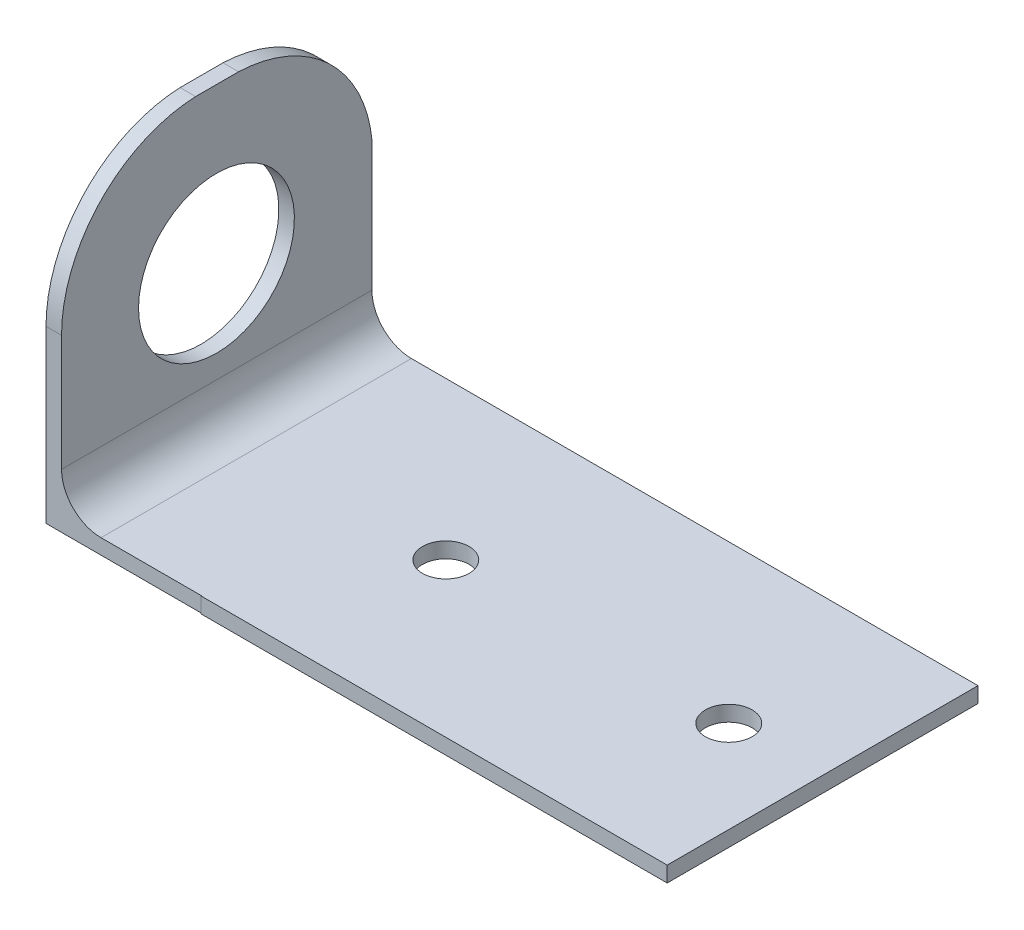
ISO-10303-21;
HEADER;
FILE_DESCRIPTION(('STEP AP214'),'2;1');
FILE_NAME('part.step','',(''),(''),'','','');
FILE_SCHEMA(('AUTOMOTIVE_DESIGN { 1 0 10303 214 1 1 1 1 }'));
ENDSEC;
DATA;
#1=APPLICATION_CONTEXT('core data for automotive mechanical design processes');
#2=APPLICATION_PROTOCOL_DEFINITION('international standard','automotive_design',2000,#1);
#3=PRODUCT_CONTEXT('',#1,'mechanical');
#4=PRODUCT('Part','Part','',(#3));
#5=PRODUCT_RELATED_PRODUCT_CATEGORY('part','',(#4));
#6=PRODUCT_DEFINITION_FORMATION('','',#4);
#7=PRODUCT_DEFINITION_CONTEXT('part definition',#1,'design');
#8=PRODUCT_DEFINITION('design','',#6,#7);
#9=PRODUCT_DEFINITION_SHAPE('','',#8);
#10=(LENGTH_UNIT() NAMED_UNIT(*) SI_UNIT(.MILLI.,.METRE.));
#11=(NAMED_UNIT(*) PLANE_ANGLE_UNIT() SI_UNIT($,.RADIAN.));
#12=(NAMED_UNIT(*) SI_UNIT($,.STERADIAN.) SOLID_ANGLE_UNIT());
#13=UNCERTAINTY_MEASURE_WITH_UNIT(LENGTH_MEASURE(1.E-05),#10,'distance_accuracy_value','');
#14=(GEOMETRIC_REPRESENTATION_CONTEXT(3) GLOBAL_UNCERTAINTY_ASSIGNED_CONTEXT((#13)) GLOBAL_UNIT_ASSIGNED_CONTEXT((#10,
#11,#12)) REPRESENTATION_CONTEXT('',''));
#15=CARTESIAN_POINT('',(0.,0.,0.));
#16=DIRECTION('',(0.,0.,1.));
#17=DIRECTION('',(1.,0.,0.));
#18=AXIS2_PLACEMENT_3D('',#15,#16,#17);
#19=CARTESIAN_POINT('',(0.,0.,20.));
#20=DIRECTION('',(1.,0.,0.));
#21=DIRECTION('',(0.,0.,-1.));
#22=AXIS2_PLACEMENT_3D('',#19,#20,#21);
#23=PLANE('',#22);
#24=CARTESIAN_POINT('',(0.,10.0362534456912,10.002916516571));
#25=DIRECTION('',(-1.,0.,0.));
#26=DIRECTION('',(0.,0.,1.));
#27=AXIS2_PLACEMENT_3D('',#24,#25,#26);
#28=CIRCLE('',#27,5.01471082260615);
#29=CARTESIAN_POINT('',(0.,10.0362534456912,15.0176273391771));
#30=VERTEX_POINT('',#29);
#31=EDGE_CURVE('E200',#30,#30,#28,.T.);
#32=ORIENTED_EDGE('',*,*,#31,.F.);
#33=EDGE_LOOP('',(#32));
#34=FACE_BOUND('',#33,.T.);
#35=CARTESIAN_POINT('',(0.,11.0076719576721,8.95236583522298));
#36=DIRECTION('',(-1.,0.,0.));
#37=DIRECTION('',(0.,0.,1.));
#38=AXIS2_PLACEMENT_3D('',#35,#36,#37);
#39=CIRCLE('',#38,9.);
#40=CARTESIAN_POINT('',(0.,20.,8.58083336132213));
#41=VERTEX_POINT('',#40);
#42=CARTESIAN_POINT('',(0.,11.9324129767322,0.));
#43=VERTEX_POINT('',#42);
#44=EDGE_CURVE('E151',#41,#43,#39,.T.);
#45=ORIENTED_EDGE('',*,*,#44,.T.);
#46=DIRECTION('',(0.,-1.,0.));
#47=VECTOR('',#46,1.);
#48=CARTESIAN_POINT('',(0.,0.,0.));
#49=LINE('',#48,#47);
#50=CARTESIAN_POINT('',(0.,0.0255102040817569,0.));
#51=VERTEX_POINT('',#50);
#52=EDGE_CURVE('E199',#43,#51,#49,.T.);
#53=ORIENTED_EDGE('',*,*,#52,.T.);
#54=DIRECTION('',(0.,0.,1.));
#55=VECTOR('',#54,1.);
#56=CARTESIAN_POINT('',(0.,0.0255102040817569,0.));
#57=LINE('',#56,#55);
#58=CARTESIAN_POINT('',(0.,0.0255102040817569,19.9722297808012));
#59=VERTEX_POINT('',#58);
#60=EDGE_CURVE('E247',#51,#59,#57,.T.);
#61=ORIENTED_EDGE('',*,*,#60,.T.);
#62=DIRECTION('',(0.,-1.,0.));
#63=VECTOR('',#62,1.);
#64=CARTESIAN_POINT('',(0.,0.,19.9722297808012));
#65=LINE('',#64,#63);
#66=CARTESIAN_POINT('',(0.,11.007671957672,19.9722297808012));
#67=VERTEX_POINT('',#66);
#68=EDGE_CURVE('E251',#67,#59,#65,.T.);
#69=ORIENTED_EDGE('',*,*,#68,.F.);
#70=CARTESIAN_POINT('',(0.,11.0076719576721,10.9722297808012));
#71=DIRECTION('',(-1.,0.,0.));
#72=DIRECTION('',(0.,0.,1.));
#73=AXIS2_PLACEMENT_3D('',#70,#71,#72);
#74=CIRCLE('',#73,9.);
#75=CARTESIAN_POINT('',(0.,20.,11.3437622547021));
#76=VERTEX_POINT('',#75);
#77=EDGE_CURVE('E169',#76,#67,#74,.F.);
#78=ORIENTED_EDGE('',*,*,#77,.F.);
#79=DIRECTION('',(0.,0.,-1.));
#80=VECTOR('',#79,1.);
#81=CARTESIAN_POINT('',(0.,20.,20.));
#82=LINE('',#81,#80);
#83=EDGE_CURVE('E166',#76,#41,#82,.T.);
#84=ORIENTED_EDGE('',*,*,#83,.T.);
#85=EDGE_LOOP('',(#45,#53,#61,#69,#78,#84));
#86=FACE_BOUND('',#85,.T.);
#87=ADVANCED_FACE('F64',(#34,#86),#23,.F.);
#88=CARTESIAN_POINT('',(0.,0.,20.));
#89=DIRECTION('',(0.,1.,0.));
#90=DIRECTION('',(0.,0.,1.));
#91=AXIS2_PLACEMENT_3D('',#88,#89,#90);
#92=PLANE('',#91);
#93=CARTESIAN_POINT('',(34.0793672831904,0.,10.1164192432048));
#94=DIRECTION('',(0.,1.,0.));
#95=DIRECTION('',(0.,0.,1.));
#96=AXIS2_PLACEMENT_3D('',#93,#94,#95);
#97=CIRCLE('',#96,1.5);
#98=CARTESIAN_POINT('',(34.0793672831904,0.,11.6164192432048));
#99=VERTEX_POINT('',#98);
#100=EDGE_CURVE('E269',#99,#99,#97,.T.);
#101=ORIENTED_EDGE('',*,*,#100,.T.);
#102=EDGE_LOOP('',(#101));
#103=FACE_BOUND('',#102,.T.);
#104=CARTESIAN_POINT('',(15.8713976459673,0.,10.1164192432048));
#105=DIRECTION('',(0.,1.,0.));
#106=DIRECTION('',(0.,0.,1.));
#107=AXIS2_PLACEMENT_3D('',#104,#105,#106);
#108=CIRCLE('',#107,1.5);
#109=CARTESIAN_POINT('',(15.8713976459673,0.,11.6164192432048));
#110=VERTEX_POINT('',#109);
#111=EDGE_CURVE('E159',#110,#110,#108,.T.);
#112=ORIENTED_EDGE('',*,*,#111,.T.);
#113=EDGE_LOOP('',(#112));
#114=FACE_BOUND('',#113,.T.);
#115=DIRECTION('',(0.,0.,1.));
#116=VECTOR('',#115,1.);
#117=CARTESIAN_POINT('',(10.,0.,0.));
#118=LINE('',#117,#116);
#119=CARTESIAN_POINT('',(10.,0.,0.));
#120=VERTEX_POINT('',#119);
#121=CARTESIAN_POINT('',(10.,0.,20.));
#122=VERTEX_POINT('',#121);
#123=EDGE_CURVE('E241',#120,#122,#118,.T.);
#124=ORIENTED_EDGE('',*,*,#123,.F.);
#125=DIRECTION('',(1.,0.,0.));
#126=VECTOR('',#125,1.);
#127=CARTESIAN_POINT('',(0.,0.,0.));
#128=LINE('',#127,#126);
#129=CARTESIAN_POINT('',(40.,0.,0.));
#130=VERTEX_POINT('',#129);
#131=EDGE_CURVE('E219',#120,#130,#128,.T.);
#132=ORIENTED_EDGE('',*,*,#131,.T.);
#133=DIRECTION('',(0.,0.,-1.));
#134=VECTOR('',#133,1.);
#135=CARTESIAN_POINT('',(40.,0.,20.));
#136=LINE('',#135,#134);
#137=CARTESIAN_POINT('',(40.,0.,20.));
#138=VERTEX_POINT('',#137);
#139=EDGE_CURVE('E187',#138,#130,#136,.T.);
#140=ORIENTED_EDGE('',*,*,#139,.F.);
#141=DIRECTION('',(1.,0.,0.));
#142=VECTOR('',#141,1.);
#143=CARTESIAN_POINT('',(0.,0.,20.));
#144=LINE('',#143,#142);
#145=EDGE_CURVE('E218',#122,#138,#144,.T.);
#146=ORIENTED_EDGE('',*,*,#145,.F.);
#147=EDGE_LOOP('',(#124,#132,#140,#146));
#148=FACE_BOUND('',#147,.T.);
#149=ADVANCED_FACE('F291',(#103,#114,#148),#92,.F.);
#150=CARTESIAN_POINT('',(1.,20.,20.));
#151=DIRECTION('',(-1.,0.,0.));
#152=DIRECTION('',(0.,-1.,0.));
#153=AXIS2_PLACEMENT_3D('',#150,#151,#152);
#154=PLANE('',#153);
#155=CARTESIAN_POINT('',(1.,10.0362534456912,10.002916516571));
#156=DIRECTION('',(-1.,0.,0.));
#157=DIRECTION('',(0.,-1.,0.));
#158=AXIS2_PLACEMENT_3D('',#155,#156,#157);
#159=CIRCLE('',#158,5.01471082260615);
#160=CARTESIAN_POINT('',(1.00000000000001,5.02154262308502,10.002916516571));
#161=VERTEX_POINT('',#160);
#162=EDGE_CURVE('E197',#161,#161,#159,.T.);
#163=ORIENTED_EDGE('',*,*,#162,.T.);
#164=EDGE_LOOP('',(#163));
#165=FACE_BOUND('',#164,.T.);
#166=CARTESIAN_POINT('',(1.,11.0076719576721,8.95236583522298));
#167=DIRECTION('',(-1.,0.,0.));
#168=DIRECTION('',(0.,-1.,0.));
#169=AXIS2_PLACEMENT_3D('',#166,#167,#168);
#170=CIRCLE('',#169,9.);
#171=CARTESIAN_POINT('',(1.,20.,8.58083336132213));
#172=VERTEX_POINT('',#171);
#173=CARTESIAN_POINT('',(1.,11.9324129767322,0.));
#174=VERTEX_POINT('',#173);
#175=EDGE_CURVE('E79',#172,#174,#170,.T.);
#176=ORIENTED_EDGE('',*,*,#175,.F.);
#177=DIRECTION('',(0.,0.,-1.));
#178=VECTOR('',#177,1.);
#179=CARTESIAN_POINT('',(1.,20.,20.));
#180=LINE('',#179,#178);
#181=CARTESIAN_POINT('',(1.,20.,11.3437622547021));
#182=VERTEX_POINT('',#181);
#183=EDGE_CURVE('E168',#182,#172,#180,.T.);
#184=ORIENTED_EDGE('',*,*,#183,.F.);
#185=CARTESIAN_POINT('',(1.,11.0076719576721,10.9722297808012));
#186=DIRECTION('',(-1.,0.,0.));
#187=DIRECTION('',(0.,-1.,0.));
#188=AXIS2_PLACEMENT_3D('',#185,#186,#187);
#189=CIRCLE('',#188,9.);
#190=CARTESIAN_POINT('',(1.00000000000001,11.007671957672,19.9722297808012));
#191=VERTEX_POINT('',#190);
#192=EDGE_CURVE('E228',#182,#191,#189,.F.);
#193=ORIENTED_EDGE('',*,*,#192,.T.);
#194=DIRECTION('',(0.,-1.,0.));
#195=VECTOR('',#194,1.);
#196=CARTESIAN_POINT('',(1.,20.,19.9722297808012));
#197=LINE('',#196,#195);
#198=CARTESIAN_POINT('',(1.00000000000001,3.54,19.9722297808012));
#199=VERTEX_POINT('',#198);
#200=EDGE_CURVE('E235',#191,#199,#197,.T.);
#201=ORIENTED_EDGE('',*,*,#200,.T.);
#202=DIRECTION('',(0.,0.,-1.));
#203=VECTOR('',#202,1.);
#204=CARTESIAN_POINT('',(1.00000000000001,3.54,0.));
#205=LINE('',#204,#203);
#206=CARTESIAN_POINT('',(1.00000000000001,3.54,0.));
#207=VERTEX_POINT('',#206);
#208=EDGE_CURVE('E190',#199,#207,#205,.T.);
#209=ORIENTED_EDGE('',*,*,#208,.T.);
#210=DIRECTION('',(0.,1.,0.));
#211=VECTOR('',#210,1.);
#212=CARTESIAN_POINT('',(1.,20.,0.));
#213=LINE('',#212,#211);
#214=EDGE_CURVE('E182',#207,#174,#213,.T.);
#215=ORIENTED_EDGE('',*,*,#214,.T.);
#216=EDGE_LOOP('',(#176,#184,#193,#201,#209,#215));
#217=FACE_BOUND('',#216,.T.);
#218=ADVANCED_FACE('F294',(#165,#217),#154,.F.);
#219=CARTESIAN_POINT('',(0.,20.,20.));
#220=DIRECTION('',(0.,-1.,0.));
#221=DIRECTION('',(0.,0.,-1.));
#222=AXIS2_PLACEMENT_3D('',#219,#220,#221);
#223=PLANE('',#222);
#224=DIRECTION('',(-1.,0.,0.));
#225=VECTOR('',#224,1.);
#226=CARTESIAN_POINT('',(10.,20.,8.58083336132213));
#227=LINE('',#226,#225);
#228=EDGE_CURVE('E154',#172,#41,#227,.T.);
#229=ORIENTED_EDGE('',*,*,#228,.T.);
#230=ORIENTED_EDGE('',*,*,#83,.F.);
#231=DIRECTION('',(-1.,0.,0.));
#232=VECTOR('',#231,1.);
#233=CARTESIAN_POINT('',(10.,20.,11.3437622547021));
#234=LINE('',#233,#232);
#235=EDGE_CURVE('E238',#182,#76,#234,.T.);
#236=ORIENTED_EDGE('',*,*,#235,.F.);
#237=ORIENTED_EDGE('',*,*,#183,.T.);
#238=EDGE_LOOP('',(#229,#230,#236,#237));
#239=FACE_BOUND('',#238,.T.);
#240=ADVANCED_FACE('F164',(#239),#223,.F.);
#241=CARTESIAN_POINT('',(0.,20.,20.));
#242=DIRECTION('',(0.,0.,-1.));
#243=DIRECTION('',(-1.,0.,0.));
#244=AXIS2_PLACEMENT_3D('',#241,#242,#243);
#245=PLANE('',#244);
#246=DIRECTION('',(0.,1.,0.));
#247=VECTOR('',#246,1.);
#248=CARTESIAN_POINT('',(10.,0.,20.));
#249=LINE('',#248,#247);
#250=CARTESIAN_POINT('',(10.,1.,20.));
#251=VERTEX_POINT('',#250);
#252=EDGE_CURVE('E250',#122,#251,#249,.T.);
#253=ORIENTED_EDGE('',*,*,#252,.F.);
#254=ORIENTED_EDGE('',*,*,#145,.T.);
#255=DIRECTION('',(0.,1.,0.));
#256=VECTOR('',#255,1.);
#257=CARTESIAN_POINT('',(40.,0.,20.));
#258=LINE('',#257,#256);
#259=CARTESIAN_POINT('',(40.,1.,20.));
#260=VERTEX_POINT('',#259);
#261=EDGE_CURVE('E179',#138,#260,#258,.T.);
#262=ORIENTED_EDGE('',*,*,#261,.T.);
#263=DIRECTION('',(-1.,0.,0.));
#264=VECTOR('',#263,1.);
#265=CARTESIAN_POINT('',(1.00000000000001,1.,20.));
#266=LINE('',#265,#264);
#267=EDGE_CURVE('E174',#260,#251,#266,.T.);
#268=ORIENTED_EDGE('',*,*,#267,.T.);
#269=EDGE_LOOP('',(#253,#254,#262,#268));
#270=FACE_BOUND('',#269,.T.);
#271=ADVANCED_FACE('F308',(#270),#245,.F.);
#272=CARTESIAN_POINT('',(0.,20.,0.));
#273=DIRECTION('',(0.,0.,-1.));
#274=DIRECTION('',(-1.,0.,0.));
#275=AXIS2_PLACEMENT_3D('',#272,#273,#274);
#276=PLANE('',#275);
#277=ORIENTED_EDGE('',*,*,#52,.F.);
#278=DIRECTION('',(-1.,0.,0.));
#279=VECTOR('',#278,1.);
#280=CARTESIAN_POINT('',(10.,11.9324129767322,0.));
#281=LINE('',#280,#279);
#282=EDGE_CURVE('E12',#43,#174,#281,.F.);
#283=ORIENTED_EDGE('',*,*,#282,.T.);
#284=ORIENTED_EDGE('',*,*,#214,.F.);
#285=CARTESIAN_POINT('',(3.54000000000001,3.54,0.));
#286=DIRECTION('',(0.,0.,-1.));
#287=DIRECTION('',(-1.,0.,0.));
#288=AXIS2_PLACEMENT_3D('',#285,#286,#287);
#289=CIRCLE('',#288,2.54);
#290=CARTESIAN_POINT('',(3.54000000000001,1.,0.));
#291=VERTEX_POINT('',#290);
#292=EDGE_CURVE('E195',#207,#291,#289,.F.);
#293=ORIENTED_EDGE('',*,*,#292,.T.);
#294=DIRECTION('',(-1.,0.,0.));
#295=VECTOR('',#294,1.);
#296=CARTESIAN_POINT('',(1.00000000000001,1.,0.));
#297=LINE('',#296,#295);
#298=CARTESIAN_POINT('',(40.,1.,0.));
#299=VERTEX_POINT('',#298);
#300=EDGE_CURVE('E211',#299,#291,#297,.T.);
#301=ORIENTED_EDGE('',*,*,#300,.F.);
#302=DIRECTION('',(0.,1.,0.));
#303=VECTOR('',#302,1.);
#304=CARTESIAN_POINT('',(40.,0.,0.));
#305=LINE('',#304,#303);
#306=EDGE_CURVE('E216',#130,#299,#305,.T.);
#307=ORIENTED_EDGE('',*,*,#306,.F.);
#308=ORIENTED_EDGE('',*,*,#131,.F.);
#309=DIRECTION('',(0.,-1.,0.));
#310=VECTOR('',#309,1.);
#311=CARTESIAN_POINT('',(10.,0.,0.));
#312=LINE('',#311,#310);
#313=CARTESIAN_POINT('',(10.,0.0255102040817569,0.));
#314=VERTEX_POINT('',#313);
#315=EDGE_CURVE('E256',#314,#120,#312,.T.);
#316=ORIENTED_EDGE('',*,*,#315,.F.);
#317=DIRECTION('',(-1.,0.,0.));
#318=VECTOR('',#317,1.);
#319=CARTESIAN_POINT('',(10.,0.0255102040817569,0.));
#320=LINE('',#319,#318);
#321=EDGE_CURVE('E237',#314,#51,#320,.T.);
#322=ORIENTED_EDGE('',*,*,#321,.T.);
#323=EDGE_LOOP('',(#277,#283,#284,#293,#301,#307,#308,#316,#322));
#324=FACE_BOUND('',#323,.T.);
#325=ADVANCED_FACE('F304',(#324),#276,.T.);
#326=CARTESIAN_POINT('',(40.,0.,20.));
#327=DIRECTION('',(-1.,0.,0.));
#328=DIRECTION('',(0.,0.,1.));
#329=AXIS2_PLACEMENT_3D('',#326,#327,#328);
#330=PLANE('',#329);
#331=ORIENTED_EDGE('',*,*,#306,.T.);
#332=DIRECTION('',(0.,0.,-1.));
#333=VECTOR('',#332,1.);
#334=CARTESIAN_POINT('',(40.,1.,20.));
#335=LINE('',#334,#333);
#336=EDGE_CURVE('E176',#260,#299,#335,.T.);
#337=ORIENTED_EDGE('',*,*,#336,.F.);
#338=ORIENTED_EDGE('',*,*,#261,.F.);
#339=ORIENTED_EDGE('',*,*,#139,.T.);
#340=EDGE_LOOP('',(#331,#337,#338,#339));
#341=FACE_BOUND('',#340,.T.);
#342=ADVANCED_FACE('F281',(#341),#330,.F.);
#343=CARTESIAN_POINT('',(1.00000000000001,1.,20.));
#344=DIRECTION('',(0.,-1.,0.));
#345=DIRECTION('',(1.,0.,0.));
#346=AXIS2_PLACEMENT_3D('',#343,#344,#345);
#347=PLANE('',#346);
#348=CARTESIAN_POINT('',(34.0793672831904,1.,10.1164192432048));
#349=DIRECTION('',(0.,1.,0.));
#350=DIRECTION('',(-1.,0.,0.));
#351=AXIS2_PLACEMENT_3D('',#348,#349,#350);
#352=CIRCLE('',#351,1.5);
#353=CARTESIAN_POINT('',(32.5793672831904,1.,10.1164192432048));
#354=VERTEX_POINT('',#353);
#355=EDGE_CURVE('E272',#354,#354,#352,.T.);
#356=ORIENTED_EDGE('',*,*,#355,.F.);
#357=EDGE_LOOP('',(#356));
#358=FACE_BOUND('',#357,.T.);
#359=CARTESIAN_POINT('',(15.8713976459673,1.,10.1164192432048));
#360=DIRECTION('',(0.,1.,0.));
#361=DIRECTION('',(-1.,0.,0.));
#362=AXIS2_PLACEMENT_3D('',#359,#360,#361);
#363=CIRCLE('',#362,1.5);
#364=CARTESIAN_POINT('',(14.3713976459673,1.,10.1164192432048));
#365=VERTEX_POINT('',#364);
#366=EDGE_CURVE('E266',#365,#365,#363,.T.);
#367=ORIENTED_EDGE('',*,*,#366,.F.);
#368=EDGE_LOOP('',(#367));
#369=FACE_BOUND('',#368,.T.);
#370=DIRECTION('',(0.,0.,-1.));
#371=VECTOR('',#370,1.);
#372=CARTESIAN_POINT('',(3.54000000000001,1.,20.));
#373=LINE('',#372,#371);
#374=CARTESIAN_POINT('',(3.54000000000001,1.,19.9722297808012));
#375=VERTEX_POINT('',#374);
#376=EDGE_CURVE('E192',#291,#375,#373,.F.);
#377=ORIENTED_EDGE('',*,*,#376,.T.);
#378=DIRECTION('',(1.,0.,0.));
#379=VECTOR('',#378,1.);
#380=CARTESIAN_POINT('',(1.00000000000001,1.,19.9722297808012));
#381=LINE('',#380,#379);
#382=CARTESIAN_POINT('',(10.,1.,19.9722297808012));
#383=VERTEX_POINT('',#382);
#384=EDGE_CURVE('E86',#375,#383,#381,.T.);
#385=ORIENTED_EDGE('',*,*,#384,.T.);
#386=DIRECTION('',(0.,0.,-1.));
#387=VECTOR('',#386,1.);
#388=CARTESIAN_POINT('',(10.,1.,20.));
#389=LINE('',#388,#387);
#390=EDGE_CURVE('E232',#251,#383,#389,.T.);
#391=ORIENTED_EDGE('',*,*,#390,.F.);
#392=ORIENTED_EDGE('',*,*,#267,.F.);
#393=ORIENTED_EDGE('',*,*,#336,.T.);
#394=ORIENTED_EDGE('',*,*,#300,.T.);
#395=EDGE_LOOP('',(#377,#385,#391,#392,#393,#394));
#396=FACE_BOUND('',#395,.T.);
#397=ADVANCED_FACE('F208',(#358,#369,#396),#347,.F.);
#398=CARTESIAN_POINT('',(3.54000000000001,3.54,20.));
#399=DIRECTION('',(0.,0.,1.));
#400=DIRECTION('',(1.,0.,0.));
#401=AXIS2_PLACEMENT_3D('',#398,#399,#400);
#402=CYLINDRICAL_SURFACE('',#401,2.54);
#403=ORIENTED_EDGE('',*,*,#208,.F.);
#404=CARTESIAN_POINT('',(3.54000000000001,3.54,19.9722297808012));
#405=DIRECTION('',(0.,0.,-1.));
#406=DIRECTION('',(-1.,0.,0.));
#407=AXIS2_PLACEMENT_3D('',#404,#405,#406);
#408=CIRCLE('',#407,2.54);
#409=EDGE_CURVE('E72',#199,#375,#408,.F.);
#410=ORIENTED_EDGE('',*,*,#409,.T.);
#411=ORIENTED_EDGE('',*,*,#376,.F.);
#412=ORIENTED_EDGE('',*,*,#292,.F.);
#413=EDGE_LOOP('',(#403,#410,#411,#412));
#414=FACE_BOUND('',#413,.T.);
#415=ADVANCED_FACE('F66',(#414),#402,.F.);
#416=CARTESIAN_POINT('',(10.,10.0362534456912,10.002916516571));
#417=DIRECTION('',(-1.,0.,0.));
#418=DIRECTION('',(0.,0.,1.));
#419=AXIS2_PLACEMENT_3D('',#416,#417,#418);
#420=CYLINDRICAL_SURFACE('',#419,5.01471082260615);
#421=ORIENTED_EDGE('',*,*,#31,.T.);
#422=EDGE_LOOP('',(#421));
#423=FACE_BOUND('',#422,.T.);
#424=ORIENTED_EDGE('',*,*,#162,.F.);
#425=EDGE_LOOP('',(#424));
#426=FACE_BOUND('',#425,.T.);
#427=ADVANCED_FACE('F321',(#423,#426),#420,.F.);
#428=CARTESIAN_POINT('',(10.,11.0076719576721,10.9722297808012));
#429=DIRECTION('',(-1.,0.,0.));
#430=DIRECTION('',(0.,0.,1.));
#431=AXIS2_PLACEMENT_3D('',#428,#429,#430);
#432=CYLINDRICAL_SURFACE('',#431,9.);
#433=ORIENTED_EDGE('',*,*,#235,.T.);
#434=ORIENTED_EDGE('',*,*,#77,.T.);
#435=DIRECTION('',(-1.,0.,0.));
#436=VECTOR('',#435,1.);
#437=CARTESIAN_POINT('',(10.,11.007671957672,19.9722297808012));
#438=LINE('',#437,#436);
#439=EDGE_CURVE('E240',#191,#67,#438,.T.);
#440=ORIENTED_EDGE('',*,*,#439,.F.);
#441=ORIENTED_EDGE('',*,*,#192,.F.);
#442=EDGE_LOOP('',(#433,#434,#440,#441));
#443=FACE_BOUND('',#442,.T.);
#444=ADVANCED_FACE('F319',(#443),#432,.T.);
#445=CARTESIAN_POINT('',(10.,0.,0.));
#446=DIRECTION('',(-1.,0.,0.));
#447=DIRECTION('',(0.,0.,1.));
#448=AXIS2_PLACEMENT_3D('',#445,#446,#447);
#449=PLANE('',#448);
#450=ORIENTED_EDGE('',*,*,#390,.T.);
#451=DIRECTION('',(0.,-1.,0.));
#452=VECTOR('',#451,1.);
#453=CARTESIAN_POINT('',(10.,0.,19.9722297808012));
#454=LINE('',#453,#452);
#455=CARTESIAN_POINT('',(10.,0.0255102040817569,19.9722297808012));
#456=VERTEX_POINT('',#455);
#457=EDGE_CURVE('E261',#383,#456,#454,.T.);
#458=ORIENTED_EDGE('',*,*,#457,.T.);
#459=DIRECTION('',(0.,0.,1.));
#460=VECTOR('',#459,1.);
#461=CARTESIAN_POINT('',(10.,0.0255102040817569,0.));
#462=LINE('',#461,#460);
#463=EDGE_CURVE('E258',#314,#456,#462,.T.);
#464=ORIENTED_EDGE('',*,*,#463,.F.);
#465=ORIENTED_EDGE('',*,*,#315,.T.);
#466=ORIENTED_EDGE('',*,*,#123,.T.);
#467=ORIENTED_EDGE('',*,*,#252,.T.);
#468=EDGE_LOOP('',(#450,#458,#464,#465,#466,#467));
#469=FACE_BOUND('',#468,.T.);
#470=ADVANCED_FACE('F309',(#469),#449,.T.);
#471=CARTESIAN_POINT('',(10.,0.,19.9722297808012));
#472=DIRECTION('',(0.,0.,-1.));
#473=DIRECTION('',(-1.,0.,0.));
#474=AXIS2_PLACEMENT_3D('',#471,#472,#473);
#475=PLANE('',#474);
#476=ORIENTED_EDGE('',*,*,#409,.F.);
#477=ORIENTED_EDGE('',*,*,#200,.F.);
#478=ORIENTED_EDGE('',*,*,#439,.T.);
#479=ORIENTED_EDGE('',*,*,#68,.T.);
#480=DIRECTION('',(-1.,0.,0.));
#481=VECTOR('',#480,1.);
#482=CARTESIAN_POINT('',(10.,0.0255102040817569,19.9722297808012));
#483=LINE('',#482,#481);
#484=EDGE_CURVE('E243',#456,#59,#483,.T.);
#485=ORIENTED_EDGE('',*,*,#484,.F.);
#486=ORIENTED_EDGE('',*,*,#457,.F.);
#487=ORIENTED_EDGE('',*,*,#384,.F.);
#488=EDGE_LOOP('',(#476,#477,#478,#479,#485,#486,#487));
#489=FACE_BOUND('',#488,.T.);
#490=ADVANCED_FACE('F312',(#489),#475,.F.);
#491=CARTESIAN_POINT('',(10.,0.0255102040817569,0.));
#492=DIRECTION('',(0.,-1.,0.));
#493=DIRECTION('',(0.,0.,-1.));
#494=AXIS2_PLACEMENT_3D('',#491,#492,#493);
#495=PLANE('',#494);
#496=ORIENTED_EDGE('',*,*,#60,.F.);
#497=ORIENTED_EDGE('',*,*,#321,.F.);
#498=ORIENTED_EDGE('',*,*,#463,.T.);
#499=ORIENTED_EDGE('',*,*,#484,.T.);
#500=EDGE_LOOP('',(#496,#497,#498,#499));
#501=FACE_BOUND('',#500,.T.);
#502=ADVANCED_FACE('F314',(#501),#495,.T.);
#503=CARTESIAN_POINT('',(10.,11.0076719576721,8.95236583522298));
#504=DIRECTION('',(-1.,0.,0.));
#505=DIRECTION('',(0.,0.,1.));
#506=AXIS2_PLACEMENT_3D('',#503,#504,#505);
#507=CYLINDRICAL_SURFACE('',#506,9.);
#508=ORIENTED_EDGE('',*,*,#175,.T.);
#509=ORIENTED_EDGE('',*,*,#282,.F.);
#510=ORIENTED_EDGE('',*,*,#44,.F.);
#511=ORIENTED_EDGE('',*,*,#228,.F.);
#512=EDGE_LOOP('',(#508,#509,#510,#511));
#513=FACE_BOUND('',#512,.T.);
#514=ADVANCED_FACE('F153',(#513),#507,.T.);
#515=CARTESIAN_POINT('',(15.8713976459673,-9.,10.1164192432048));
#516=DIRECTION('',(0.,1.,0.));
#517=DIRECTION('',(-1.,0.,0.));
#518=AXIS2_PLACEMENT_3D('',#515,#516,#517);
#519=CYLINDRICAL_SURFACE('',#518,1.5);
#520=ORIENTED_EDGE('',*,*,#366,.T.);
#521=EDGE_LOOP('',(#520));
#522=FACE_BOUND('',#521,.T.);
#523=ORIENTED_EDGE('',*,*,#111,.F.);
#524=EDGE_LOOP('',(#523));
#525=FACE_BOUND('',#524,.T.);
#526=ADVANCED_FACE('F285',(#522,#525),#519,.F.);
#527=CARTESIAN_POINT('',(34.0793672831904,-29.,10.1164192432048));
#528=DIRECTION('',(0.,1.,0.));
#529=DIRECTION('',(-1.,0.,0.));
#530=AXIS2_PLACEMENT_3D('',#527,#528,#529);
#531=CYLINDRICAL_SURFACE('',#530,1.5);
#532=ORIENTED_EDGE('',*,*,#355,.T.);
#533=EDGE_LOOP('',(#532));
#534=FACE_BOUND('',#533,.T.);
#535=ORIENTED_EDGE('',*,*,#100,.F.);
#536=EDGE_LOOP('',(#535));
#537=FACE_BOUND('',#536,.T.);
#538=ADVANCED_FACE('F276',(#534,#537),#531,.F.);
#539=CLOSED_SHELL('',(#87,#149,#218,#240,#271,#325,#342,#397,#415,#427,#444,#470,#490,#502,#514,
#526,#538));
#540=MANIFOLD_SOLID_BREP('B2',#539);
#541=ADVANCED_BREP_SHAPE_REPRESENTATION('',(#18,#540),#14);
#542=SHAPE_DEFINITION_REPRESENTATION(#9,#541);
ENDSEC;
END-ISO-10303-21;
